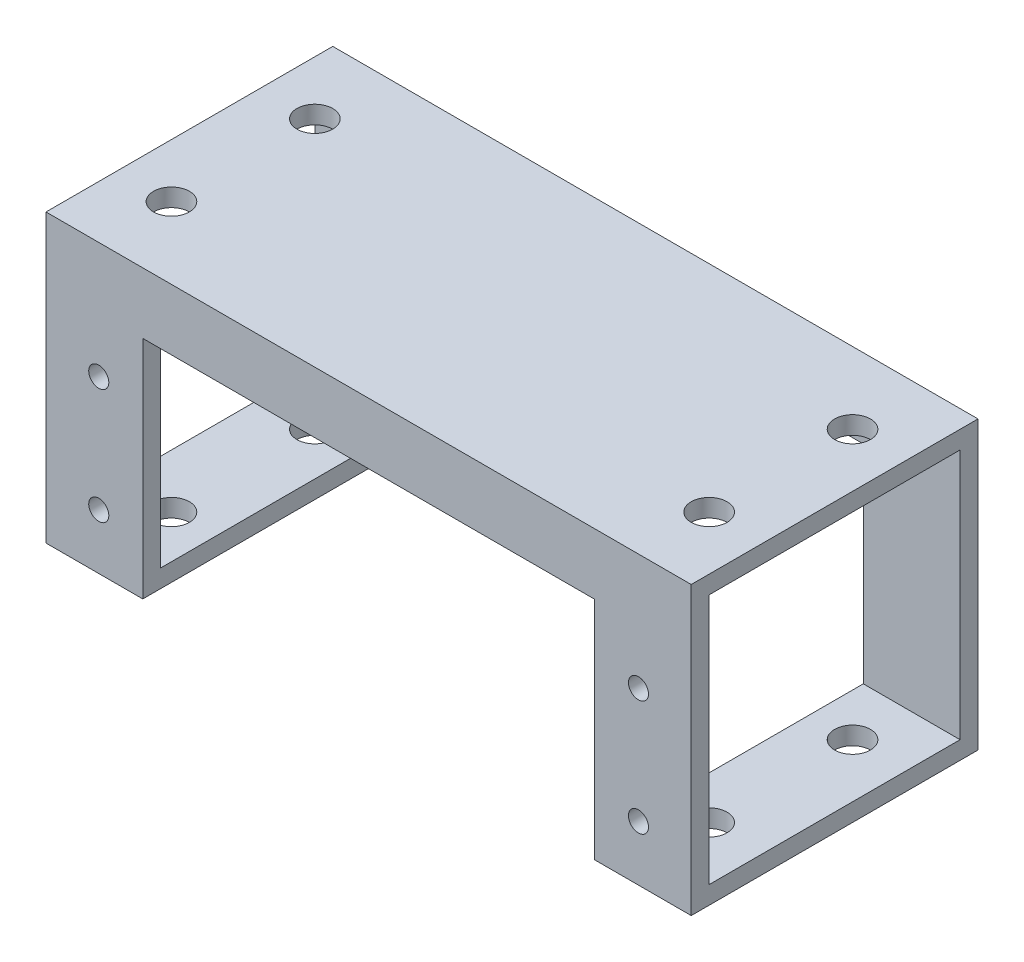
ISO-10303-21;
HEADER;
FILE_DESCRIPTION(('STEP AP214'),'2;1');
FILE_NAME('part.step','',(''),(''),'','','');
FILE_SCHEMA(('AUTOMOTIVE_DESIGN { 1 0 10303 214 1 1 1 1 }'));
ENDSEC;
DATA;
#1=APPLICATION_CONTEXT('core data for automotive mechanical design processes');
#2=APPLICATION_PROTOCOL_DEFINITION('international standard','automotive_design',2000,#1);
#3=PRODUCT_CONTEXT('',#1,'mechanical');
#4=PRODUCT('Part','Part','',(#3));
#5=PRODUCT_RELATED_PRODUCT_CATEGORY('part','',(#4));
#6=PRODUCT_DEFINITION_FORMATION('','',#4);
#7=PRODUCT_DEFINITION_CONTEXT('part definition',#1,'design');
#8=PRODUCT_DEFINITION('design','',#6,#7);
#9=PRODUCT_DEFINITION_SHAPE('','',#8);
#10=(LENGTH_UNIT() NAMED_UNIT(*) SI_UNIT(.MILLI.,.METRE.));
#11=(NAMED_UNIT(*) PLANE_ANGLE_UNIT() SI_UNIT($,.RADIAN.));
#12=(NAMED_UNIT(*) SI_UNIT($,.STERADIAN.) SOLID_ANGLE_UNIT());
#13=UNCERTAINTY_MEASURE_WITH_UNIT(LENGTH_MEASURE(1.E-05),#10,'distance_accuracy_value','');
#14=(GEOMETRIC_REPRESENTATION_CONTEXT(3) GLOBAL_UNCERTAINTY_ASSIGNED_CONTEXT((#13)) GLOBAL_UNIT_ASSIGNED_CONTEXT((#10,
#11,#12)) REPRESENTATION_CONTEXT('',''));
#15=CARTESIAN_POINT('',(0.,0.,0.));
#16=DIRECTION('',(0.,0.,1.));
#17=DIRECTION('',(1.,0.,0.));
#18=AXIS2_PLACEMENT_3D('',#15,#16,#17);
#19=CARTESIAN_POINT('',(57.15,0.,0.));
#20=DIRECTION('',(0.,1.,0.));
#21=DIRECTION('',(0.,0.,1.));
#22=AXIS2_PLACEMENT_3D('',#19,#20,#21);
#23=PLANE('',#22);
#24=CARTESIAN_POINT('',(4.7625,0.,-6.35));
#25=DIRECTION('',(0.,1.,0.));
#26=DIRECTION('',(0.,0.,1.));
#27=AXIS2_PLACEMENT_3D('',#24,#25,#26);
#28=CIRCLE('',#27,1.5875);
#29=CARTESIAN_POINT('',(4.7625,0.,-4.7625));
#30=VERTEX_POINT('',#29);
#31=EDGE_CURVE('E199',#30,#30,#28,.F.);
#32=ORIENTED_EDGE('',*,*,#31,.F.);
#33=EDGE_LOOP('',(#32));
#34=FACE_BOUND('',#33,.T.);
#35=CARTESIAN_POINT('',(4.7625,0.,-19.05));
#36=DIRECTION('',(0.,1.,0.));
#37=DIRECTION('',(0.,0.,1.));
#38=AXIS2_PLACEMENT_3D('',#35,#36,#37);
#39=CIRCLE('',#38,1.5875);
#40=CARTESIAN_POINT('',(4.7625,0.,-17.4625));
#41=VERTEX_POINT('',#40);
#42=EDGE_CURVE('E195',#41,#41,#39,.F.);
#43=ORIENTED_EDGE('',*,*,#42,.F.);
#44=EDGE_LOOP('',(#43));
#45=FACE_BOUND('',#44,.T.);
#46=DIRECTION('',(-1.,0.,0.));
#47=VECTOR('',#46,1.);
#48=CARTESIAN_POINT('',(57.15,0.,-25.4));
#49=LINE('',#48,#47);
#50=CARTESIAN_POINT('',(8.5725,0.,-25.4));
#51=VERTEX_POINT('',#50);
#52=CARTESIAN_POINT('',(0.,0.,-25.4));
#53=VERTEX_POINT('',#52);
#54=EDGE_CURVE('E174',#51,#53,#49,.T.);
#55=ORIENTED_EDGE('',*,*,#54,.F.);
#56=DIRECTION('',(0.,0.,1.));
#57=VECTOR('',#56,1.);
#58=CARTESIAN_POINT('',(8.5725,0.,-25.401));
#59=LINE('',#58,#57);
#60=CARTESIAN_POINT('',(8.5725,0.,0.));
#61=VERTEX_POINT('',#60);
#62=EDGE_CURVE('E159',#51,#61,#59,.T.);
#63=ORIENTED_EDGE('',*,*,#62,.T.);
#64=DIRECTION('',(-1.,0.,0.));
#65=VECTOR('',#64,1.);
#66=CARTESIAN_POINT('',(57.15,0.,0.));
#67=LINE('',#66,#65);
#68=CARTESIAN_POINT('',(0.,0.,0.));
#69=VERTEX_POINT('',#68);
#70=EDGE_CURVE('E52',#61,#69,#67,.T.);
#71=ORIENTED_EDGE('',*,*,#70,.T.);
#72=DIRECTION('',(0.,0.,-1.));
#73=VECTOR('',#72,1.);
#74=CARTESIAN_POINT('',(0.,0.,0.));
#75=LINE('',#74,#73);
#76=EDGE_CURVE('E180',#69,#53,#75,.T.);
#77=ORIENTED_EDGE('',*,*,#76,.T.);
#78=EDGE_LOOP('',(#55,#63,#71,#77));
#79=FACE_BOUND('',#78,.T.);
#80=ADVANCED_FACE('F43',(#34,#45,#79),#23,.F.);
#81=CARTESIAN_POINT('',(57.15,1.5875,-1.5875));
#82=DIRECTION('',(0.,1.,0.));
#83=DIRECTION('',(0.,0.,1.));
#84=AXIS2_PLACEMENT_3D('',#81,#82,#83);
#85=PLANE('',#84);
#86=CARTESIAN_POINT('',(4.7625,1.5875,-6.35));
#87=DIRECTION('',(0.,1.,0.));
#88=DIRECTION('',(0.,0.,1.));
#89=AXIS2_PLACEMENT_3D('',#86,#87,#88);
#90=CIRCLE('',#89,1.5875);
#91=CARTESIAN_POINT('',(4.7625,1.5875,-4.7625));
#92=VERTEX_POINT('',#91);
#93=EDGE_CURVE('E198',#92,#92,#90,.T.);
#94=ORIENTED_EDGE('',*,*,#93,.F.);
#95=EDGE_LOOP('',(#94));
#96=FACE_BOUND('',#95,.T.);
#97=CARTESIAN_POINT('',(4.7625,1.5875,-19.05));
#98=DIRECTION('',(0.,1.,0.));
#99=DIRECTION('',(0.,0.,1.));
#100=AXIS2_PLACEMENT_3D('',#97,#98,#99);
#101=CIRCLE('',#100,1.5875);
#102=CARTESIAN_POINT('',(4.7625,1.5875,-17.4625));
#103=VERTEX_POINT('',#102);
#104=EDGE_CURVE('E194',#103,#103,#101,.T.);
#105=ORIENTED_EDGE('',*,*,#104,.F.);
#106=EDGE_LOOP('',(#105));
#107=FACE_BOUND('',#106,.T.);
#108=DIRECTION('',(0.,0.,-1.));
#109=VECTOR('',#108,1.);
#110=CARTESIAN_POINT('',(8.5725,1.5875,-25.401));
#111=LINE('',#110,#109);
#112=CARTESIAN_POINT('',(8.5725,1.5875,-1.5875));
#113=VERTEX_POINT('',#112);
#114=CARTESIAN_POINT('',(8.5725,1.5875,-23.8125));
#115=VERTEX_POINT('',#114);
#116=EDGE_CURVE('E264',#113,#115,#111,.T.);
#117=ORIENTED_EDGE('',*,*,#116,.T.);
#118=DIRECTION('',(-1.,0.,0.));
#119=VECTOR('',#118,1.);
#120=CARTESIAN_POINT('',(57.15,1.5875,-23.8125));
#121=LINE('',#120,#119);
#122=CARTESIAN_POINT('',(0.,1.5875,-23.8125));
#123=VERTEX_POINT('',#122);
#124=EDGE_CURVE('E318',#115,#123,#121,.T.);
#125=ORIENTED_EDGE('',*,*,#124,.T.);
#126=DIRECTION('',(0.,0.,-1.));
#127=VECTOR('',#126,1.);
#128=CARTESIAN_POINT('',(0.,1.5875,-1.5875));
#129=LINE('',#128,#127);
#130=CARTESIAN_POINT('',(0.,1.5875,-1.5875));
#131=VERTEX_POINT('',#130);
#132=EDGE_CURVE('E306',#131,#123,#129,.T.);
#133=ORIENTED_EDGE('',*,*,#132,.F.);
#134=DIRECTION('',(-1.,0.,0.));
#135=VECTOR('',#134,1.);
#136=CARTESIAN_POINT('',(57.15,1.5875,-1.5875));
#137=LINE('',#136,#135);
#138=EDGE_CURVE('E322',#113,#131,#137,.T.);
#139=ORIENTED_EDGE('',*,*,#138,.F.);
#140=EDGE_LOOP('',(#117,#125,#133,#139));
#141=FACE_BOUND('',#140,.T.);
#142=ADVANCED_FACE('F390',(#96,#107,#141),#85,.T.);
#143=CARTESIAN_POINT('',(57.15,25.4,0.));
#144=DIRECTION('',(-1.,0.,0.));
#145=DIRECTION('',(0.,0.,1.));
#146=AXIS2_PLACEMENT_3D('',#143,#144,#145);
#147=PLANE('',#146);
#148=DIRECTION('',(0.,-1.,0.));
#149=VECTOR('',#148,1.);
#150=CARTESIAN_POINT('',(57.15,0.,0.));
#151=LINE('',#150,#149);
#152=CARTESIAN_POINT('',(57.15,25.4,0.));
#153=VERTEX_POINT('',#152);
#154=CARTESIAN_POINT('',(57.15,0.,0.));
#155=VERTEX_POINT('',#154);
#156=EDGE_CURVE('E327',#153,#155,#151,.T.);
#157=ORIENTED_EDGE('',*,*,#156,.T.);
#158=DIRECTION('',(0.,0.,-1.));
#159=VECTOR('',#158,1.);
#160=CARTESIAN_POINT('',(57.15,0.,0.));
#161=LINE('',#160,#159);
#162=CARTESIAN_POINT('',(57.15,0.,-25.4));
#163=VERTEX_POINT('',#162);
#164=EDGE_CURVE('E330',#155,#163,#161,.T.);
#165=ORIENTED_EDGE('',*,*,#164,.T.);
#166=DIRECTION('',(0.,1.,0.));
#167=VECTOR('',#166,1.);
#168=CARTESIAN_POINT('',(57.15,0.,-25.4));
#169=LINE('',#168,#167);
#170=CARTESIAN_POINT('',(57.15,25.4,-25.4));
#171=VERTEX_POINT('',#170);
#172=EDGE_CURVE('E333',#163,#171,#169,.T.);
#173=ORIENTED_EDGE('',*,*,#172,.T.);
#174=DIRECTION('',(0.,0.,1.));
#175=VECTOR('',#174,1.);
#176=CARTESIAN_POINT('',(57.15,25.4,0.));
#177=LINE('',#176,#175);
#178=EDGE_CURVE('E335',#171,#153,#177,.T.);
#179=ORIENTED_EDGE('',*,*,#178,.T.);
#180=EDGE_LOOP('',(#157,#165,#173,#179));
#181=FACE_BOUND('',#180,.T.);
#182=DIRECTION('',(0.,-1.,0.));
#183=VECTOR('',#182,1.);
#184=CARTESIAN_POINT('',(57.15,1.5875,-1.5875));
#185=LINE('',#184,#183);
#186=CARTESIAN_POINT('',(57.15,23.8125,-1.5875));
#187=VERTEX_POINT('',#186);
#188=CARTESIAN_POINT('',(57.15,1.5875,-1.5875));
#189=VERTEX_POINT('',#188);
#190=EDGE_CURVE('E293',#187,#189,#185,.T.);
#191=ORIENTED_EDGE('',*,*,#190,.F.);
#192=DIRECTION('',(0.,0.,1.));
#193=VECTOR('',#192,1.);
#194=CARTESIAN_POINT('',(57.15,23.8125,-1.5875));
#195=LINE('',#194,#193);
#196=CARTESIAN_POINT('',(57.15,23.8125,-23.8125));
#197=VERTEX_POINT('',#196);
#198=EDGE_CURVE('E301',#197,#187,#195,.T.);
#199=ORIENTED_EDGE('',*,*,#198,.F.);
#200=DIRECTION('',(0.,1.,0.));
#201=VECTOR('',#200,1.);
#202=CARTESIAN_POINT('',(57.15,1.5875,-23.8125));
#203=LINE('',#202,#201);
#204=CARTESIAN_POINT('',(57.15,1.5875,-23.8125));
#205=VERTEX_POINT('',#204);
#206=EDGE_CURVE('E298',#205,#197,#203,.T.);
#207=ORIENTED_EDGE('',*,*,#206,.F.);
#208=DIRECTION('',(0.,0.,-1.));
#209=VECTOR('',#208,1.);
#210=CARTESIAN_POINT('',(57.15,1.5875,-1.5875));
#211=LINE('',#210,#209);
#212=EDGE_CURVE('E295',#189,#205,#211,.T.);
#213=ORIENTED_EDGE('',*,*,#212,.F.);
#214=EDGE_LOOP('',(#191,#199,#207,#213));
#215=FACE_BOUND('',#214,.T.);
#216=ADVANCED_FACE('F358',(#181,#215),#147,.F.);
#217=CARTESIAN_POINT('',(0.,25.4,0.));
#218=DIRECTION('',(-1.,0.,0.));
#219=DIRECTION('',(0.,0.,1.));
#220=AXIS2_PLACEMENT_3D('',#217,#218,#219);
#221=PLANE('',#220);
#222=DIRECTION('',(0.,-1.,0.));
#223=VECTOR('',#222,1.);
#224=CARTESIAN_POINT('',(0.,0.,0.));
#225=LINE('',#224,#223);
#226=CARTESIAN_POINT('',(0.,25.4,0.));
#227=VERTEX_POINT('',#226);
#228=EDGE_CURVE('E326',#227,#69,#225,.T.);
#229=ORIENTED_EDGE('',*,*,#228,.F.);
#230=DIRECTION('',(0.,0.,1.));
#231=VECTOR('',#230,1.);
#232=CARTESIAN_POINT('',(0.,25.4,0.));
#233=LINE('',#232,#231);
#234=CARTESIAN_POINT('',(0.,25.4,-25.4));
#235=VERTEX_POINT('',#234);
#236=EDGE_CURVE('E331',#235,#227,#233,.T.);
#237=ORIENTED_EDGE('',*,*,#236,.F.);
#238=DIRECTION('',(0.,1.,0.));
#239=VECTOR('',#238,1.);
#240=CARTESIAN_POINT('',(0.,0.,-25.4));
#241=LINE('',#240,#239);
#242=EDGE_CURVE('E340',#53,#235,#241,.T.);
#243=ORIENTED_EDGE('',*,*,#242,.F.);
#244=ORIENTED_EDGE('',*,*,#76,.F.);
#245=EDGE_LOOP('',(#229,#237,#243,#244));
#246=FACE_BOUND('',#245,.T.);
#247=DIRECTION('',(0.,0.,1.));
#248=VECTOR('',#247,1.);
#249=CARTESIAN_POINT('',(0.,23.8125,-1.5875));
#250=LINE('',#249,#248);
#251=CARTESIAN_POINT('',(0.,23.8125,-23.8125));
#252=VERTEX_POINT('',#251);
#253=CARTESIAN_POINT('',(0.,23.8125,-1.5875));
#254=VERTEX_POINT('',#253);
#255=EDGE_CURVE('E296',#252,#254,#250,.T.);
#256=ORIENTED_EDGE('',*,*,#255,.T.);
#257=DIRECTION('',(0.,-1.,0.));
#258=VECTOR('',#257,1.);
#259=CARTESIAN_POINT('',(0.,1.5875,-1.5875));
#260=LINE('',#259,#258);
#261=EDGE_CURVE('E292',#254,#131,#260,.T.);
#262=ORIENTED_EDGE('',*,*,#261,.T.);
#263=ORIENTED_EDGE('',*,*,#132,.T.);
#264=DIRECTION('',(0.,1.,0.));
#265=VECTOR('',#264,1.);
#266=CARTESIAN_POINT('',(0.,1.5875,-23.8125));
#267=LINE('',#266,#265);
#268=EDGE_CURVE('E309',#123,#252,#267,.T.);
#269=ORIENTED_EDGE('',*,*,#268,.T.);
#270=EDGE_LOOP('',(#256,#262,#263,#269));
#271=FACE_BOUND('',#270,.T.);
#272=ADVANCED_FACE('F352',(#246,#271),#221,.T.);
#273=CARTESIAN_POINT('',(57.15,0.,0.));
#274=DIRECTION('',(0.,0.,-1.));
#275=DIRECTION('',(-1.,0.,0.));
#276=AXIS2_PLACEMENT_3D('',#273,#274,#275);
#277=PLANE('',#276);
#278=CARTESIAN_POINT('',(52.4764,4.88950000000001,0.));
#279=DIRECTION('',(0.,0.,1.));
#280=DIRECTION('',(1.,0.,0.));
#281=AXIS2_PLACEMENT_3D('',#278,#279,#280);
#282=CIRCLE('',#281,0.889000000000003);
#283=CARTESIAN_POINT('',(53.3654,4.88950000000001,0.));
#284=VERTEX_POINT('',#283);
#285=EDGE_CURVE('E235',#284,#284,#282,.T.);
#286=ORIENTED_EDGE('',*,*,#285,.F.);
#287=EDGE_LOOP('',(#286));
#288=FACE_BOUND('',#287,.T.);
#289=CARTESIAN_POINT('',(52.4764,15.1003,0.));
#290=DIRECTION('',(0.,0.,1.));
#291=DIRECTION('',(1.,0.,0.));
#292=AXIS2_PLACEMENT_3D('',#289,#290,#291);
#293=CIRCLE('',#292,0.889000000000003);
#294=CARTESIAN_POINT('',(53.3654,15.1003,0.));
#295=VERTEX_POINT('',#294);
#296=EDGE_CURVE('E241',#295,#295,#293,.T.);
#297=ORIENTED_EDGE('',*,*,#296,.F.);
#298=EDGE_LOOP('',(#297));
#299=FACE_BOUND('',#298,.T.);
#300=CARTESIAN_POINT('',(4.67360000000001,4.88949999999999,0.));
#301=DIRECTION('',(0.,0.,1.));
#302=DIRECTION('',(1.,0.,0.));
#303=AXIS2_PLACEMENT_3D('',#300,#301,#302);
#304=CIRCLE('',#303,0.889);
#305=CARTESIAN_POINT('',(5.56260000000001,4.88949999999999,0.));
#306=VERTEX_POINT('',#305);
#307=EDGE_CURVE('E247',#306,#306,#304,.T.);
#308=ORIENTED_EDGE('',*,*,#307,.F.);
#309=EDGE_LOOP('',(#308));
#310=FACE_BOUND('',#309,.T.);
#311=CARTESIAN_POINT('',(4.67360000000001,15.1003,0.));
#312=DIRECTION('',(0.,0.,1.));
#313=DIRECTION('',(1.,0.,0.));
#314=AXIS2_PLACEMENT_3D('',#311,#312,#313);
#315=CIRCLE('',#314,0.888999999999998);
#316=CARTESIAN_POINT('',(5.56260000000001,15.1003,0.));
#317=VERTEX_POINT('',#316);
#318=EDGE_CURVE('E253',#317,#317,#315,.T.);
#319=ORIENTED_EDGE('',*,*,#318,.F.);
#320=EDGE_LOOP('',(#319));
#321=FACE_BOUND('',#320,.T.);
#322=ORIENTED_EDGE('',*,*,#70,.F.);
#323=DIRECTION('',(0.,-1.,0.));
#324=VECTOR('',#323,1.);
#325=CARTESIAN_POINT('',(8.5725,0.,0.));
#326=LINE('',#325,#324);
#327=CARTESIAN_POINT('',(8.57250000000001,19.9898,0.));
#328=VERTEX_POINT('',#327);
#329=EDGE_CURVE('E165',#328,#61,#326,.T.);
#330=ORIENTED_EDGE('',*,*,#329,.F.);
#331=DIRECTION('',(-1.,0.,0.));
#332=VECTOR('',#331,1.);
#333=CARTESIAN_POINT('',(8.57250000000001,19.9898,0.));
#334=LINE('',#333,#332);
#335=CARTESIAN_POINT('',(48.5775,19.9898,0.));
#336=VERTEX_POINT('',#335);
#337=EDGE_CURVE('E170',#336,#328,#334,.T.);
#338=ORIENTED_EDGE('',*,*,#337,.F.);
#339=DIRECTION('',(0.,1.,0.));
#340=VECTOR('',#339,1.);
#341=CARTESIAN_POINT('',(48.5775,0.,0.));
#342=LINE('',#341,#340);
#343=CARTESIAN_POINT('',(48.5775,0.,0.));
#344=VERTEX_POINT('',#343);
#345=EDGE_CURVE('E274',#344,#336,#342,.T.);
#346=ORIENTED_EDGE('',*,*,#345,.F.);
#347=EDGE_CURVE('E13',#155,#344,#67,.T.);
#348=ORIENTED_EDGE('',*,*,#347,.F.);
#349=ORIENTED_EDGE('',*,*,#156,.F.);
#350=DIRECTION('',(-1.,0.,0.));
#351=VECTOR('',#350,1.);
#352=CARTESIAN_POINT('',(57.15,25.4,0.));
#353=LINE('',#352,#351);
#354=EDGE_CURVE('E187',#153,#227,#353,.T.);
#355=ORIENTED_EDGE('',*,*,#354,.T.);
#356=ORIENTED_EDGE('',*,*,#228,.T.);
#357=EDGE_LOOP('',(#322,#330,#338,#346,#348,#349,#355,#356));
#358=FACE_BOUND('',#357,.T.);
#359=ADVANCED_FACE('F45',(#288,#299,#310,#321,#358),#277,.F.);
#360=CARTESIAN_POINT('',(52.3875,0.,-6.35000000000002));
#361=DIRECTION('',(0.,1.,0.));
#362=DIRECTION('',(0.,0.,1.));
#363=AXIS2_PLACEMENT_3D('',#360,#361,#362);
#364=CIRCLE('',#363,1.5875);
#365=CARTESIAN_POINT('',(52.3875,0.,-4.76250000000002));
#366=VERTEX_POINT('',#365);
#367=EDGE_CURVE('E421',#366,#366,#364,.F.);
#368=ORIENTED_EDGE('',*,*,#367,.F.);
#369=EDGE_LOOP('',(#368));
#370=FACE_BOUND('',#369,.T.);
#371=CARTESIAN_POINT('',(52.3875,0.,-19.05));
#372=DIRECTION('',(0.,1.,0.));
#373=DIRECTION('',(0.,0.,1.));
#374=AXIS2_PLACEMENT_3D('',#371,#372,#373);
#375=CIRCLE('',#374,1.58749999999998);
#376=CARTESIAN_POINT('',(52.3875,0.,-17.4625));
#377=VERTEX_POINT('',#376);
#378=EDGE_CURVE('E203',#377,#377,#375,.F.);
#379=ORIENTED_EDGE('',*,*,#378,.F.);
#380=EDGE_LOOP('',(#379));
#381=FACE_BOUND('',#380,.T.);
#382=ORIENTED_EDGE('',*,*,#347,.T.);
#383=DIRECTION('',(0.,0.,1.));
#384=VECTOR('',#383,1.);
#385=CARTESIAN_POINT('',(48.5775,0.,-25.401));
#386=LINE('',#385,#384);
#387=CARTESIAN_POINT('',(48.5775,0.,-25.4));
#388=VERTEX_POINT('',#387);
#389=EDGE_CURVE('E169',#388,#344,#386,.T.);
#390=ORIENTED_EDGE('',*,*,#389,.F.);
#391=EDGE_CURVE('E182',#163,#388,#49,.T.);
#392=ORIENTED_EDGE('',*,*,#391,.F.);
#393=ORIENTED_EDGE('',*,*,#164,.F.);
#394=EDGE_LOOP('',(#382,#390,#392,#393));
#395=FACE_BOUND('',#394,.T.);
#396=ADVANCED_FACE('F363',(#370,#381,#395),#23,.F.);
#397=CARTESIAN_POINT('',(57.15,0.,-25.4));
#398=DIRECTION('',(0.,0.,1.));
#399=DIRECTION('',(1.,0.,0.));
#400=AXIS2_PLACEMENT_3D('',#397,#398,#399);
#401=PLANE('',#400);
#402=DIRECTION('',(1.,0.,0.));
#403=VECTOR('',#402,1.);
#404=CARTESIAN_POINT('',(8.57250000000001,19.9898,-25.4));
#405=LINE('',#404,#403);
#406=CARTESIAN_POINT('',(8.57250000000001,19.9898,-25.4));
#407=VERTEX_POINT('',#406);
#408=CARTESIAN_POINT('',(48.5775,19.9898,-25.4));
#409=VERTEX_POINT('',#408);
#410=EDGE_CURVE('E60',#407,#409,#405,.T.);
#411=ORIENTED_EDGE('',*,*,#410,.F.);
#412=DIRECTION('',(0.,1.,0.));
#413=VECTOR('',#412,1.);
#414=CARTESIAN_POINT('',(8.5725,0.,-25.4));
#415=LINE('',#414,#413);
#416=EDGE_CURVE('E163',#51,#407,#415,.T.);
#417=ORIENTED_EDGE('',*,*,#416,.F.);
#418=ORIENTED_EDGE('',*,*,#54,.T.);
#419=ORIENTED_EDGE('',*,*,#242,.T.);
#420=DIRECTION('',(-1.,0.,0.));
#421=VECTOR('',#420,1.);
#422=CARTESIAN_POINT('',(57.15,25.4,-25.4));
#423=LINE('',#422,#421);
#424=EDGE_CURVE('E183',#171,#235,#423,.T.);
#425=ORIENTED_EDGE('',*,*,#424,.F.);
#426=ORIENTED_EDGE('',*,*,#172,.F.);
#427=ORIENTED_EDGE('',*,*,#391,.T.);
#428=DIRECTION('',(0.,-1.,0.));
#429=VECTOR('',#428,1.);
#430=CARTESIAN_POINT('',(48.5775,0.,-25.4));
#431=LINE('',#430,#429);
#432=EDGE_CURVE('E256',#409,#388,#431,.T.);
#433=ORIENTED_EDGE('',*,*,#432,.F.);
#434=EDGE_LOOP('',(#411,#417,#418,#419,#425,#426,#427,#433));
#435=FACE_BOUND('',#434,.T.);
#436=ADVANCED_FACE('F173',(#435),#401,.F.);
#437=CARTESIAN_POINT('',(57.15,25.4,0.));
#438=DIRECTION('',(0.,-1.,0.));
#439=DIRECTION('',(0.,0.,-1.));
#440=AXIS2_PLACEMENT_3D('',#437,#438,#439);
#441=PLANE('',#440);
#442=CARTESIAN_POINT('',(52.3875,25.4,-6.35000000000002));
#443=DIRECTION('',(0.,1.,0.));
#444=DIRECTION('',(0.,0.,1.));
#445=AXIS2_PLACEMENT_3D('',#442,#443,#444);
#446=CIRCLE('',#445,1.5875);
#447=CARTESIAN_POINT('',(52.3875,25.4,-4.76250000000002));
#448=VERTEX_POINT('',#447);
#449=EDGE_CURVE('E423',#448,#448,#446,.T.);
#450=ORIENTED_EDGE('',*,*,#449,.F.);
#451=EDGE_LOOP('',(#450));
#452=FACE_BOUND('',#451,.T.);
#453=CARTESIAN_POINT('',(52.3875,25.4,-19.05));
#454=DIRECTION('',(0.,1.,0.));
#455=DIRECTION('',(0.,0.,1.));
#456=AXIS2_PLACEMENT_3D('',#453,#454,#455);
#457=CIRCLE('',#456,1.58749999999998);
#458=CARTESIAN_POINT('',(52.3875,25.4,-17.4625));
#459=VERTEX_POINT('',#458);
#460=EDGE_CURVE('E210',#459,#459,#457,.T.);
#461=ORIENTED_EDGE('',*,*,#460,.F.);
#462=EDGE_LOOP('',(#461));
#463=FACE_BOUND('',#462,.T.);
#464=CARTESIAN_POINT('',(4.7625,25.4,-6.35));
#465=DIRECTION('',(0.,1.,0.));
#466=DIRECTION('',(0.,0.,1.));
#467=AXIS2_PLACEMENT_3D('',#464,#465,#466);
#468=CIRCLE('',#467,1.5875);
#469=CARTESIAN_POINT('',(4.7625,25.4,-4.7625));
#470=VERTEX_POINT('',#469);
#471=EDGE_CURVE('E207',#470,#470,#468,.T.);
#472=ORIENTED_EDGE('',*,*,#471,.F.);
#473=EDGE_LOOP('',(#472));
#474=FACE_BOUND('',#473,.T.);
#475=CARTESIAN_POINT('',(4.7625,25.4,-19.05));
#476=DIRECTION('',(0.,1.,0.));
#477=DIRECTION('',(0.,0.,1.));
#478=AXIS2_PLACEMENT_3D('',#475,#476,#477);
#479=CIRCLE('',#478,1.5875);
#480=CARTESIAN_POINT('',(4.7625,25.4,-17.4625));
#481=VERTEX_POINT('',#480);
#482=EDGE_CURVE('E225',#481,#481,#479,.T.);
#483=ORIENTED_EDGE('',*,*,#482,.F.);
#484=EDGE_LOOP('',(#483));
#485=FACE_BOUND('',#484,.T.);
#486=ORIENTED_EDGE('',*,*,#236,.T.);
#487=ORIENTED_EDGE('',*,*,#354,.F.);
#488=ORIENTED_EDGE('',*,*,#178,.F.);
#489=ORIENTED_EDGE('',*,*,#424,.T.);
#490=EDGE_LOOP('',(#486,#487,#488,#489));
#491=FACE_BOUND('',#490,.T.);
#492=ADVANCED_FACE('F356',(#452,#463,#474,#485,#491),#441,.F.);
#493=CARTESIAN_POINT('',(57.15,1.5875,-1.5875));
#494=DIRECTION('',(0.,0.,-1.));
#495=DIRECTION('',(-1.,0.,0.));
#496=AXIS2_PLACEMENT_3D('',#493,#494,#495);
#497=PLANE('',#496);
#498=CARTESIAN_POINT('',(52.4764,4.88950000000001,-1.5875));
#499=DIRECTION('',(0.,0.,-1.));
#500=DIRECTION('',(-1.,0.,0.));
#501=AXIS2_PLACEMENT_3D('',#498,#499,#500);
#502=CIRCLE('',#501,0.889000000000003);
#503=CARTESIAN_POINT('',(51.5874,4.88950000000001,-1.5875));
#504=VERTEX_POINT('',#503);
#505=EDGE_CURVE('E232',#504,#504,#502,.F.);
#506=ORIENTED_EDGE('',*,*,#505,.T.);
#507=EDGE_LOOP('',(#506));
#508=FACE_BOUND('',#507,.T.);
#509=CARTESIAN_POINT('',(52.4764,15.1003,-1.5875));
#510=DIRECTION('',(0.,0.,-1.));
#511=DIRECTION('',(-1.,0.,0.));
#512=AXIS2_PLACEMENT_3D('',#509,#510,#511);
#513=CIRCLE('',#512,0.889000000000003);
#514=CARTESIAN_POINT('',(51.5874,15.1003,-1.5875));
#515=VERTEX_POINT('',#514);
#516=EDGE_CURVE('E238',#515,#515,#513,.F.);
#517=ORIENTED_EDGE('',*,*,#516,.T.);
#518=EDGE_LOOP('',(#517));
#519=FACE_BOUND('',#518,.T.);
#520=CARTESIAN_POINT('',(4.67360000000001,4.88949999999999,-1.5875));
#521=DIRECTION('',(0.,0.,-1.));
#522=DIRECTION('',(-1.,0.,0.));
#523=AXIS2_PLACEMENT_3D('',#520,#521,#522);
#524=CIRCLE('',#523,0.889);
#525=CARTESIAN_POINT('',(3.78460000000001,4.88949999999999,-1.5875));
#526=VERTEX_POINT('',#525);
#527=EDGE_CURVE('E244',#526,#526,#524,.F.);
#528=ORIENTED_EDGE('',*,*,#527,.T.);
#529=EDGE_LOOP('',(#528));
#530=FACE_BOUND('',#529,.T.);
#531=CARTESIAN_POINT('',(4.67360000000001,15.1003,-1.5875));
#532=DIRECTION('',(0.,0.,-1.));
#533=DIRECTION('',(-1.,0.,0.));
#534=AXIS2_PLACEMENT_3D('',#531,#532,#533);
#535=CIRCLE('',#534,0.888999999999998);
#536=CARTESIAN_POINT('',(3.78460000000002,15.1003,-1.5875));
#537=VERTEX_POINT('',#536);
#538=EDGE_CURVE('E250',#537,#537,#535,.F.);
#539=ORIENTED_EDGE('',*,*,#538,.T.);
#540=EDGE_LOOP('',(#539));
#541=FACE_BOUND('',#540,.T.);
#542=DIRECTION('',(0.,-1.,0.));
#543=VECTOR('',#542,1.);
#544=CARTESIAN_POINT('',(8.5725,0.,-1.5875));
#545=LINE('',#544,#543);
#546=CARTESIAN_POINT('',(8.57250000000001,19.9898,-1.5875));
#547=VERTEX_POINT('',#546);
#548=EDGE_CURVE('E270',#547,#113,#545,.T.);
#549=ORIENTED_EDGE('',*,*,#548,.T.);
#550=ORIENTED_EDGE('',*,*,#138,.T.);
#551=ORIENTED_EDGE('',*,*,#261,.F.);
#552=DIRECTION('',(-1.,0.,0.));
#553=VECTOR('',#552,1.);
#554=CARTESIAN_POINT('',(57.15,23.8125,-1.5875));
#555=LINE('',#554,#553);
#556=EDGE_CURVE('E303',#187,#254,#555,.T.);
#557=ORIENTED_EDGE('',*,*,#556,.F.);
#558=ORIENTED_EDGE('',*,*,#190,.T.);
#559=CARTESIAN_POINT('',(48.5775,1.5875,-1.5875));
#560=VERTEX_POINT('',#559);
#561=EDGE_CURVE('E323',#189,#560,#137,.T.);
#562=ORIENTED_EDGE('',*,*,#561,.T.);
#563=DIRECTION('',(0.,1.,0.));
#564=VECTOR('',#563,1.);
#565=CARTESIAN_POINT('',(48.5775,0.,-1.5875));
#566=LINE('',#565,#564);
#567=CARTESIAN_POINT('',(48.5775,19.9898,-1.5875));
#568=VERTEX_POINT('',#567);
#569=EDGE_CURVE('E289',#560,#568,#566,.T.);
#570=ORIENTED_EDGE('',*,*,#569,.T.);
#571=DIRECTION('',(-1.,0.,0.));
#572=VECTOR('',#571,1.);
#573=CARTESIAN_POINT('',(8.57250000000001,19.9898,-1.5875));
#574=LINE('',#573,#572);
#575=EDGE_CURVE('E267',#568,#547,#574,.T.);
#576=ORIENTED_EDGE('',*,*,#575,.T.);
#577=EDGE_LOOP('',(#549,#550,#551,#557,#558,#562,#570,#576));
#578=FACE_BOUND('',#577,.T.);
#579=ADVANCED_FACE('F372',(#508,#519,#530,#541,#578),#497,.T.);
#580=CARTESIAN_POINT('',(52.3875,1.5875,-6.35000000000002));
#581=DIRECTION('',(0.,1.,0.));
#582=DIRECTION('',(0.,0.,1.));
#583=AXIS2_PLACEMENT_3D('',#580,#581,#582);
#584=CIRCLE('',#583,1.5875);
#585=CARTESIAN_POINT('',(52.3875,1.5875,-4.76250000000002));
#586=VERTEX_POINT('',#585);
#587=EDGE_CURVE('E215',#586,#586,#584,.T.);
#588=ORIENTED_EDGE('',*,*,#587,.F.);
#589=EDGE_LOOP('',(#588));
#590=FACE_BOUND('',#589,.T.);
#591=CARTESIAN_POINT('',(52.3875,1.5875,-19.05));
#592=DIRECTION('',(0.,1.,0.));
#593=DIRECTION('',(0.,0.,1.));
#594=AXIS2_PLACEMENT_3D('',#591,#592,#593);
#595=CIRCLE('',#594,1.58749999999998);
#596=CARTESIAN_POINT('',(52.3875,1.5875,-17.4625));
#597=VERTEX_POINT('',#596);
#598=EDGE_CURVE('E202',#597,#597,#595,.T.);
#599=ORIENTED_EDGE('',*,*,#598,.F.);
#600=EDGE_LOOP('',(#599));
#601=FACE_BOUND('',#600,.T.);
#602=DIRECTION('',(0.,0.,1.));
#603=VECTOR('',#602,1.);
#604=CARTESIAN_POINT('',(48.5775,1.5875,-25.401));
#605=LINE('',#604,#603);
#606=CARTESIAN_POINT('',(48.5775,1.5875,-23.8125));
#607=VERTEX_POINT('',#606);
#608=EDGE_CURVE('E68',#607,#560,#605,.T.);
#609=ORIENTED_EDGE('',*,*,#608,.T.);
#610=ORIENTED_EDGE('',*,*,#561,.F.);
#611=ORIENTED_EDGE('',*,*,#212,.T.);
#612=EDGE_CURVE('E319',#205,#607,#121,.T.);
#613=ORIENTED_EDGE('',*,*,#612,.T.);
#614=EDGE_LOOP('',(#609,#610,#611,#613));
#615=FACE_BOUND('',#614,.T.);
#616=ADVANCED_FACE('F378',(#590,#601,#615),#85,.T.);
#617=CARTESIAN_POINT('',(57.15,1.5875,-23.8125));
#618=DIRECTION('',(0.,0.,1.));
#619=DIRECTION('',(1.,0.,0.));
#620=AXIS2_PLACEMENT_3D('',#617,#618,#619);
#621=PLANE('',#620);
#622=DIRECTION('',(0.,1.,0.));
#623=VECTOR('',#622,1.);
#624=CARTESIAN_POINT('',(8.5725,0.,-23.8125));
#625=LINE('',#624,#623);
#626=CARTESIAN_POINT('',(8.57250000000001,19.9898,-23.8125));
#627=VERTEX_POINT('',#626);
#628=EDGE_CURVE('E261',#115,#627,#625,.T.);
#629=ORIENTED_EDGE('',*,*,#628,.T.);
#630=DIRECTION('',(1.,0.,0.));
#631=VECTOR('',#630,1.);
#632=CARTESIAN_POINT('',(8.57250000000001,19.9898,-23.8125));
#633=LINE('',#632,#631);
#634=CARTESIAN_POINT('',(48.5775,19.9898,-23.8125));
#635=VERTEX_POINT('',#634);
#636=EDGE_CURVE('E177',#627,#635,#633,.T.);
#637=ORIENTED_EDGE('',*,*,#636,.T.);
#638=DIRECTION('',(0.,-1.,0.));
#639=VECTOR('',#638,1.);
#640=CARTESIAN_POINT('',(48.5775,0.,-23.8125));
#641=LINE('',#640,#639);
#642=EDGE_CURVE('E286',#635,#607,#641,.T.);
#643=ORIENTED_EDGE('',*,*,#642,.T.);
#644=ORIENTED_EDGE('',*,*,#612,.F.);
#645=ORIENTED_EDGE('',*,*,#206,.T.);
#646=DIRECTION('',(-1.,0.,0.));
#647=VECTOR('',#646,1.);
#648=CARTESIAN_POINT('',(57.15,23.8125,-23.8125));
#649=LINE('',#648,#647);
#650=EDGE_CURVE('E316',#197,#252,#649,.T.);
#651=ORIENTED_EDGE('',*,*,#650,.T.);
#652=ORIENTED_EDGE('',*,*,#268,.F.);
#653=ORIENTED_EDGE('',*,*,#124,.F.);
#654=EDGE_LOOP('',(#629,#637,#643,#644,#645,#651,#652,#653));
#655=FACE_BOUND('',#654,.T.);
#656=ADVANCED_FACE('F383',(#655),#621,.T.);
#657=CARTESIAN_POINT('',(57.15,23.8125,-1.5875));
#658=DIRECTION('',(0.,-1.,0.));
#659=DIRECTION('',(0.,0.,-1.));
#660=AXIS2_PLACEMENT_3D('',#657,#658,#659);
#661=PLANE('',#660);
#662=CARTESIAN_POINT('',(52.3875,23.8125,-6.35000000000002));
#663=DIRECTION('',(0.,-1.,0.));
#664=DIRECTION('',(0.,0.,-1.));
#665=AXIS2_PLACEMENT_3D('',#662,#663,#664);
#666=CIRCLE('',#665,1.5875);
#667=CARTESIAN_POINT('',(52.3875,23.8125,-7.93750000000002));
#668=VERTEX_POINT('',#667);
#669=EDGE_CURVE('E47',#668,#668,#666,.T.);
#670=ORIENTED_EDGE('',*,*,#669,.F.);
#671=EDGE_LOOP('',(#670));
#672=FACE_BOUND('',#671,.T.);
#673=CARTESIAN_POINT('',(52.3875,23.8125,-19.05));
#674=DIRECTION('',(0.,-1.,0.));
#675=DIRECTION('',(0.,0.,-1.));
#676=AXIS2_PLACEMENT_3D('',#673,#674,#675);
#677=CIRCLE('',#676,1.58749999999998);
#678=CARTESIAN_POINT('',(52.3875,23.8125,-20.6375));
#679=VERTEX_POINT('',#678);
#680=EDGE_CURVE('E200',#679,#679,#677,.T.);
#681=ORIENTED_EDGE('',*,*,#680,.F.);
#682=EDGE_LOOP('',(#681));
#683=FACE_BOUND('',#682,.T.);
#684=CARTESIAN_POINT('',(4.7625,23.8125,-6.35));
#685=DIRECTION('',(0.,-1.,0.));
#686=DIRECTION('',(0.,0.,-1.));
#687=AXIS2_PLACEMENT_3D('',#684,#685,#686);
#688=CIRCLE('',#687,1.5875);
#689=CARTESIAN_POINT('',(4.7625,23.8125,-7.9375));
#690=VERTEX_POINT('',#689);
#691=EDGE_CURVE('E196',#690,#690,#688,.T.);
#692=ORIENTED_EDGE('',*,*,#691,.F.);
#693=EDGE_LOOP('',(#692));
#694=FACE_BOUND('',#693,.T.);
#695=CARTESIAN_POINT('',(4.7625,23.8125,-19.05));
#696=DIRECTION('',(0.,-1.,0.));
#697=DIRECTION('',(0.,0.,-1.));
#698=AXIS2_PLACEMENT_3D('',#695,#696,#697);
#699=CIRCLE('',#698,1.5875);
#700=CARTESIAN_POINT('',(4.7625,23.8125,-20.6375));
#701=VERTEX_POINT('',#700);
#702=EDGE_CURVE('E191',#701,#701,#699,.T.);
#703=ORIENTED_EDGE('',*,*,#702,.F.);
#704=EDGE_LOOP('',(#703));
#705=FACE_BOUND('',#704,.T.);
#706=ORIENTED_EDGE('',*,*,#255,.F.);
#707=ORIENTED_EDGE('',*,*,#650,.F.);
#708=ORIENTED_EDGE('',*,*,#198,.T.);
#709=ORIENTED_EDGE('',*,*,#556,.T.);
#710=EDGE_LOOP('',(#706,#707,#708,#709));
#711=FACE_BOUND('',#710,.T.);
#712=ADVANCED_FACE('F393',(#672,#683,#694,#705,#711),#661,.T.);
#713=CARTESIAN_POINT('',(8.5725,0.,-25.401));
#714=DIRECTION('',(-1.,0.,0.));
#715=DIRECTION('',(0.,-1.,0.));
#716=AXIS2_PLACEMENT_3D('',#713,#714,#715);
#717=PLANE('',#716);
#718=ORIENTED_EDGE('',*,*,#416,.T.);
#719=DIRECTION('',(0.,0.,1.));
#720=VECTOR('',#719,1.);
#721=CARTESIAN_POINT('',(8.57250000000001,19.9898,-25.401));
#722=LINE('',#721,#720);
#723=EDGE_CURVE('E281',#407,#627,#722,.T.);
#724=ORIENTED_EDGE('',*,*,#723,.T.);
#725=ORIENTED_EDGE('',*,*,#628,.F.);
#726=ORIENTED_EDGE('',*,*,#116,.F.);
#727=ORIENTED_EDGE('',*,*,#548,.F.);
#728=EDGE_CURVE('E279',#547,#328,#722,.T.);
#729=ORIENTED_EDGE('',*,*,#728,.T.);
#730=ORIENTED_EDGE('',*,*,#329,.T.);
#731=ORIENTED_EDGE('',*,*,#62,.F.);
#732=EDGE_LOOP('',(#718,#724,#725,#726,#727,#729,#730,#731));
#733=FACE_BOUND('',#732,.T.);
#734=ADVANCED_FACE('F161',(#733),#717,.F.);
#735=CARTESIAN_POINT('',(8.57250000000001,19.9898,-25.401));
#736=DIRECTION('',(0.,1.,0.));
#737=DIRECTION('',(-1.,0.,0.));
#738=AXIS2_PLACEMENT_3D('',#735,#736,#737);
#739=PLANE('',#738);
#740=ORIENTED_EDGE('',*,*,#410,.T.);
#741=DIRECTION('',(0.,0.,1.));
#742=VECTOR('',#741,1.);
#743=CARTESIAN_POINT('',(48.5775,19.9898,-25.401));
#744=LINE('',#743,#742);
#745=EDGE_CURVE('E282',#409,#635,#744,.T.);
#746=ORIENTED_EDGE('',*,*,#745,.T.);
#747=ORIENTED_EDGE('',*,*,#636,.F.);
#748=ORIENTED_EDGE('',*,*,#723,.F.);
#749=EDGE_LOOP('',(#740,#746,#747,#748));
#750=FACE_BOUND('',#749,.T.);
#751=ADVANCED_FACE('F386',(#750),#739,.F.);
#752=EDGE_CURVE('E283',#568,#336,#744,.T.);
#753=ORIENTED_EDGE('',*,*,#752,.T.);
#754=ORIENTED_EDGE('',*,*,#337,.T.);
#755=ORIENTED_EDGE('',*,*,#728,.F.);
#756=ORIENTED_EDGE('',*,*,#575,.F.);
#757=EDGE_LOOP('',(#753,#754,#755,#756));
#758=FACE_BOUND('',#757,.T.);
#759=ADVANCED_FACE('F370',(#758),#739,.F.);
#760=CARTESIAN_POINT('',(48.5775,0.,-25.401));
#761=DIRECTION('',(1.,0.,0.));
#762=DIRECTION('',(0.,1.,0.));
#763=AXIS2_PLACEMENT_3D('',#760,#761,#762);
#764=PLANE('',#763);
#765=ORIENTED_EDGE('',*,*,#432,.T.);
#766=ORIENTED_EDGE('',*,*,#389,.T.);
#767=ORIENTED_EDGE('',*,*,#345,.T.);
#768=ORIENTED_EDGE('',*,*,#752,.F.);
#769=ORIENTED_EDGE('',*,*,#569,.F.);
#770=ORIENTED_EDGE('',*,*,#608,.F.);
#771=ORIENTED_EDGE('',*,*,#642,.F.);
#772=ORIENTED_EDGE('',*,*,#745,.F.);
#773=EDGE_LOOP('',(#765,#766,#767,#768,#769,#770,#771,#772));
#774=FACE_BOUND('',#773,.T.);
#775=ADVANCED_FACE('F365',(#774),#764,.F.);
#776=CARTESIAN_POINT('',(4.67360000000001,15.1003,-25.401));
#777=DIRECTION('',(0.,0.,1.));
#778=DIRECTION('',(1.,0.,0.));
#779=AXIS2_PLACEMENT_3D('',#776,#777,#778);
#780=CYLINDRICAL_SURFACE('',#779,0.888999999999998);
#781=ORIENTED_EDGE('',*,*,#538,.F.);
#782=EDGE_LOOP('',(#781));
#783=FACE_BOUND('',#782,.T.);
#784=ORIENTED_EDGE('',*,*,#318,.T.);
#785=EDGE_LOOP('',(#784));
#786=FACE_BOUND('',#785,.T.);
#787=ADVANCED_FACE('F470',(#783,#786),#780,.F.);
#788=CARTESIAN_POINT('',(4.67360000000001,4.88949999999999,-25.401));
#789=DIRECTION('',(0.,0.,1.));
#790=DIRECTION('',(1.,0.,0.));
#791=AXIS2_PLACEMENT_3D('',#788,#789,#790);
#792=CYLINDRICAL_SURFACE('',#791,0.889);
#793=ORIENTED_EDGE('',*,*,#527,.F.);
#794=EDGE_LOOP('',(#793));
#795=FACE_BOUND('',#794,.T.);
#796=ORIENTED_EDGE('',*,*,#307,.T.);
#797=EDGE_LOOP('',(#796));
#798=FACE_BOUND('',#797,.T.);
#799=ADVANCED_FACE('F466',(#795,#798),#792,.F.);
#800=CARTESIAN_POINT('',(52.4764,15.1003,-25.401));
#801=DIRECTION('',(0.,0.,1.));
#802=DIRECTION('',(1.,0.,0.));
#803=AXIS2_PLACEMENT_3D('',#800,#801,#802);
#804=CYLINDRICAL_SURFACE('',#803,0.889000000000003);
#805=ORIENTED_EDGE('',*,*,#516,.F.);
#806=EDGE_LOOP('',(#805));
#807=FACE_BOUND('',#806,.T.);
#808=ORIENTED_EDGE('',*,*,#296,.T.);
#809=EDGE_LOOP('',(#808));
#810=FACE_BOUND('',#809,.T.);
#811=ADVANCED_FACE('F462',(#807,#810),#804,.F.);
#812=CARTESIAN_POINT('',(52.4764,4.88950000000001,-25.401));
#813=DIRECTION('',(0.,0.,1.));
#814=DIRECTION('',(1.,0.,0.));
#815=AXIS2_PLACEMENT_3D('',#812,#813,#814);
#816=CYLINDRICAL_SURFACE('',#815,0.889000000000003);
#817=ORIENTED_EDGE('',*,*,#505,.F.);
#818=EDGE_LOOP('',(#817));
#819=FACE_BOUND('',#818,.T.);
#820=ORIENTED_EDGE('',*,*,#285,.T.);
#821=EDGE_LOOP('',(#820));
#822=FACE_BOUND('',#821,.T.);
#823=ADVANCED_FACE('F458',(#819,#822),#816,.F.);
#824=CARTESIAN_POINT('',(4.7625,-4.49012806053458,-19.05));
#825=DIRECTION('',(0.,1.,0.));
#826=DIRECTION('',(0.,0.,1.));
#827=AXIS2_PLACEMENT_3D('',#824,#825,#826);
#828=CYLINDRICAL_SURFACE('',#827,1.5875);
#829=ORIENTED_EDGE('',*,*,#702,.T.);
#830=EDGE_LOOP('',(#829));
#831=FACE_BOUND('',#830,.T.);
#832=ORIENTED_EDGE('',*,*,#482,.T.);
#833=EDGE_LOOP('',(#832));
#834=FACE_BOUND('',#833,.T.);
#835=ADVANCED_FACE('F455',(#831,#834),#828,.F.);
#836=ORIENTED_EDGE('',*,*,#104,.T.);
#837=EDGE_LOOP('',(#836));
#838=FACE_BOUND('',#837,.T.);
#839=ORIENTED_EDGE('',*,*,#42,.T.);
#840=EDGE_LOOP('',(#839));
#841=FACE_BOUND('',#840,.T.);
#842=ADVANCED_FACE('F453',(#838,#841),#828,.F.);
#843=CARTESIAN_POINT('',(4.7625,-4.49012806053458,-6.35));
#844=DIRECTION('',(0.,1.,0.));
#845=DIRECTION('',(0.,0.,1.));
#846=AXIS2_PLACEMENT_3D('',#843,#844,#845);
#847=CYLINDRICAL_SURFACE('',#846,1.5875);
#848=ORIENTED_EDGE('',*,*,#691,.T.);
#849=EDGE_LOOP('',(#848));
#850=FACE_BOUND('',#849,.T.);
#851=ORIENTED_EDGE('',*,*,#471,.T.);
#852=EDGE_LOOP('',(#851));
#853=FACE_BOUND('',#852,.T.);
#854=ADVANCED_FACE('F450',(#850,#853),#847,.F.);
#855=ORIENTED_EDGE('',*,*,#93,.T.);
#856=EDGE_LOOP('',(#855));
#857=FACE_BOUND('',#856,.T.);
#858=ORIENTED_EDGE('',*,*,#31,.T.);
#859=EDGE_LOOP('',(#858));
#860=FACE_BOUND('',#859,.T.);
#861=ADVANCED_FACE('F448',(#857,#860),#847,.F.);
#862=CARTESIAN_POINT('',(52.3875,-4.49012806053458,-19.05));
#863=DIRECTION('',(0.,1.,0.));
#864=DIRECTION('',(0.,0.,1.));
#865=AXIS2_PLACEMENT_3D('',#862,#863,#864);
#866=CYLINDRICAL_SURFACE('',#865,1.58749999999998);
#867=ORIENTED_EDGE('',*,*,#680,.T.);
#868=EDGE_LOOP('',(#867));
#869=FACE_BOUND('',#868,.T.);
#870=ORIENTED_EDGE('',*,*,#460,.T.);
#871=EDGE_LOOP('',(#870));
#872=FACE_BOUND('',#871,.T.);
#873=ADVANCED_FACE('F440',(#869,#872),#866,.F.);
#874=ORIENTED_EDGE('',*,*,#598,.T.);
#875=EDGE_LOOP('',(#874));
#876=FACE_BOUND('',#875,.T.);
#877=ORIENTED_EDGE('',*,*,#378,.T.);
#878=EDGE_LOOP('',(#877));
#879=FACE_BOUND('',#878,.T.);
#880=ADVANCED_FACE('F437',(#876,#879),#866,.F.);
#881=CARTESIAN_POINT('',(52.3875,-4.49012806053458,-6.35000000000002));
#882=DIRECTION('',(0.,1.,0.));
#883=DIRECTION('',(0.,0.,1.));
#884=AXIS2_PLACEMENT_3D('',#881,#882,#883);
#885=CYLINDRICAL_SURFACE('',#884,1.5875);
#886=ORIENTED_EDGE('',*,*,#669,.T.);
#887=EDGE_LOOP('',(#886));
#888=FACE_BOUND('',#887,.T.);
#889=ORIENTED_EDGE('',*,*,#449,.T.);
#890=EDGE_LOOP('',(#889));
#891=FACE_BOUND('',#890,.T.);
#892=ADVANCED_FACE('F439',(#888,#891),#885,.F.);
#893=ORIENTED_EDGE('',*,*,#587,.T.);
#894=EDGE_LOOP('',(#893));
#895=FACE_BOUND('',#894,.T.);
#896=ORIENTED_EDGE('',*,*,#367,.T.);
#897=EDGE_LOOP('',(#896));
#898=FACE_BOUND('',#897,.T.);
#899=ADVANCED_FACE('F431',(#895,#898),#885,.F.);
#900=CLOSED_SHELL('',(#80,#142,#216,#272,#359,#396,#436,#492,#579,#616,#656,#712,#734,#751,#759,
#775,#787,#799,#811,#823,#835,#842,#854,#861,#873,#880,#892,#899));
#901=MANIFOLD_SOLID_BREP('B2',#900);
#902=ADVANCED_BREP_SHAPE_REPRESENTATION('',(#18,#901),#14);
#903=SHAPE_DEFINITION_REPRESENTATION(#9,#902);
ENDSEC;
END-ISO-10303-21;
